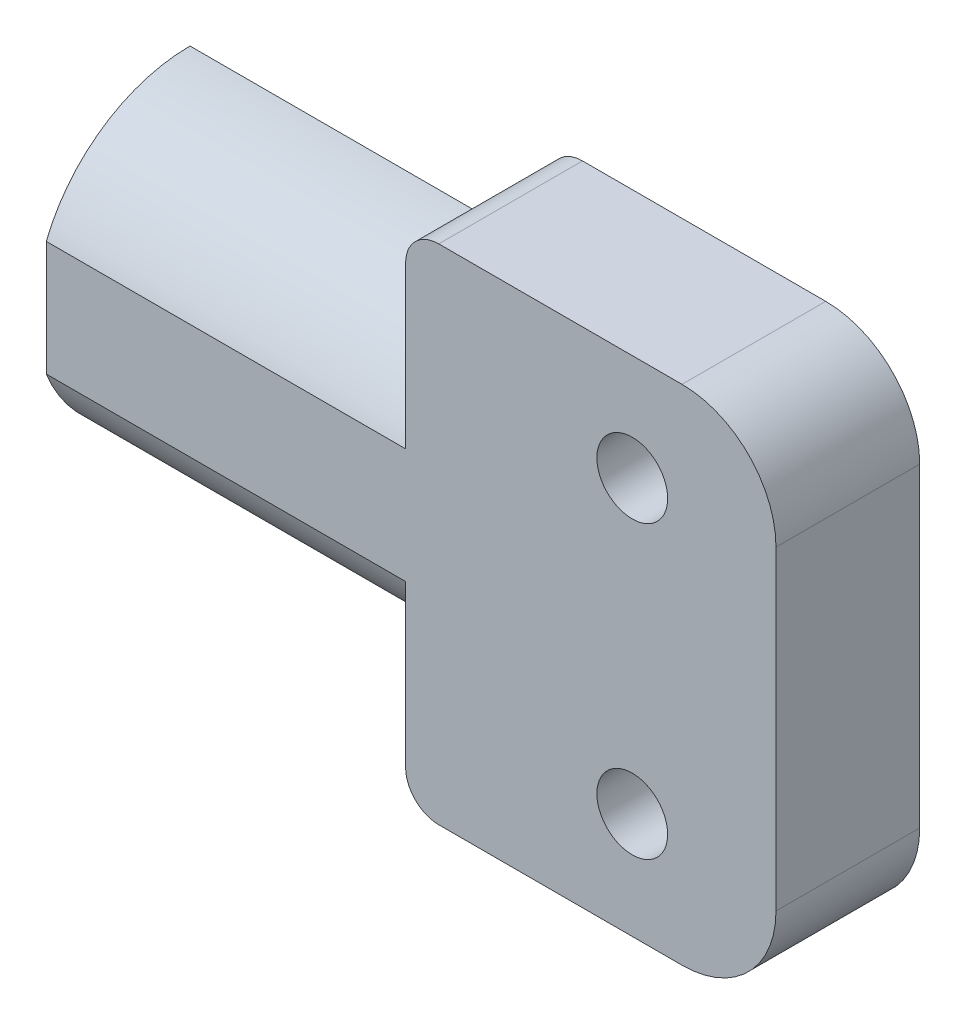
ISO-10303-21;
HEADER;
FILE_DESCRIPTION(('STEP AP214'),'2;1');
FILE_NAME('part.step','',(''),(''),'','','');
FILE_SCHEMA(('AUTOMOTIVE_DESIGN { 1 0 10303 214 1 1 1 1 }'));
ENDSEC;
DATA;
#1=APPLICATION_CONTEXT('core data for automotive mechanical design processes');
#2=APPLICATION_PROTOCOL_DEFINITION('international standard','automotive_design',2000,#1);
#3=PRODUCT_CONTEXT('',#1,'mechanical');
#4=PRODUCT('Part','Part','',(#3));
#5=PRODUCT_RELATED_PRODUCT_CATEGORY('part','',(#4));
#6=PRODUCT_DEFINITION_FORMATION('','',#4);
#7=PRODUCT_DEFINITION_CONTEXT('part definition',#1,'design');
#8=PRODUCT_DEFINITION('design','',#6,#7);
#9=PRODUCT_DEFINITION_SHAPE('','',#8);
#10=(LENGTH_UNIT() NAMED_UNIT(*) SI_UNIT(.MILLI.,.METRE.));
#11=(NAMED_UNIT(*) PLANE_ANGLE_UNIT() SI_UNIT($,.RADIAN.));
#12=(NAMED_UNIT(*) SI_UNIT($,.STERADIAN.) SOLID_ANGLE_UNIT());
#13=UNCERTAINTY_MEASURE_WITH_UNIT(LENGTH_MEASURE(1.E-05),#10,'distance_accuracy_value','');
#14=(GEOMETRIC_REPRESENTATION_CONTEXT(3) GLOBAL_UNCERTAINTY_ASSIGNED_CONTEXT((#13)) GLOBAL_UNIT_ASSIGNED_CONTEXT((#10,
#11,#12)) REPRESENTATION_CONTEXT('',''));
#15=CARTESIAN_POINT('',(0.,0.,0.));
#16=DIRECTION('',(0.,0.,1.));
#17=DIRECTION('',(1.,0.,0.));
#18=AXIS2_PLACEMENT_3D('',#15,#16,#17);
#19=CARTESIAN_POINT('',(157.,109.,110.1));
#20=DIRECTION('',(0.,0.,1.));
#21=DIRECTION('',(1.,0.,0.));
#22=AXIS2_PLACEMENT_3D('',#19,#20,#21);
#23=PLANE('',#22);
#24=CARTESIAN_POINT('',(177.,95.845,110.1));
#25=DIRECTION('',(0.,0.,-1.));
#26=DIRECTION('',(-1.,0.,0.));
#27=AXIS2_PLACEMENT_3D('',#24,#25,#26);
#28=CIRCLE('',#27,3.2);
#29=CARTESIAN_POINT('',(173.8,95.845,110.1));
#30=VERTEX_POINT('',#29);
#31=EDGE_CURVE('E160',#30,#30,#28,.T.);
#32=ORIENTED_EDGE('',*,*,#31,.T.);
#33=EDGE_LOOP('',(#32));
#34=FACE_BOUND('',#33,.T.);
#35=CARTESIAN_POINT('',(177.,122.155,110.1));
#36=DIRECTION('',(0.,0.,-1.));
#37=DIRECTION('',(-1.,0.,0.));
#38=AXIS2_PLACEMENT_3D('',#35,#36,#37);
#39=CIRCLE('',#38,3.2);
#40=CARTESIAN_POINT('',(173.8,122.155,110.1));
#41=VERTEX_POINT('',#40);
#42=EDGE_CURVE('E163',#41,#41,#39,.T.);
#43=ORIENTED_EDGE('',*,*,#42,.T.);
#44=EDGE_LOOP('',(#43));
#45=FACE_BOUND('',#44,.T.);
#46=CARTESIAN_POINT('',(159.5,89.25,110.1));
#47=DIRECTION('',(0.,0.,1.));
#48=DIRECTION('',(1.,0.,0.));
#49=AXIS2_PLACEMENT_3D('',#46,#47,#48);
#50=CIRCLE('',#49,3.);
#51=CARTESIAN_POINT('',(159.5,86.25,110.1));
#52=VERTEX_POINT('',#51);
#53=CARTESIAN_POINT('',(156.5,89.25,110.1));
#54=VERTEX_POINT('',#53);
#55=EDGE_CURVE('E168',#52,#54,#50,.F.);
#56=ORIENTED_EDGE('',*,*,#55,.F.);
#57=DIRECTION('',(1.,0.,0.));
#58=VECTOR('',#57,1.);
#59=CARTESIAN_POINT('',(156.5,86.25,110.1));
#60=LINE('',#59,#58);
#61=CARTESIAN_POINT('',(181.5,86.25,110.1));
#62=VERTEX_POINT('',#61);
#63=EDGE_CURVE('E129',#62,#52,#60,.F.);
#64=ORIENTED_EDGE('',*,*,#63,.F.);
#65=CARTESIAN_POINT('',(181.5,94.75,110.1));
#66=DIRECTION('',(0.,0.,1.));
#67=DIRECTION('',(1.,0.,0.));
#68=AXIS2_PLACEMENT_3D('',#65,#66,#67);
#69=CIRCLE('',#68,8.5);
#70=CARTESIAN_POINT('',(190.,94.75,110.1));
#71=VERTEX_POINT('',#70);
#72=EDGE_CURVE('E116',#71,#62,#69,.F.);
#73=ORIENTED_EDGE('',*,*,#72,.F.);
#74=DIRECTION('',(0.,1.,0.));
#75=VECTOR('',#74,1.);
#76=CARTESIAN_POINT('',(190.,86.25,110.1));
#77=LINE('',#76,#75);
#78=CARTESIAN_POINT('',(190.,123.25,110.1));
#79=VERTEX_POINT('',#78);
#80=EDGE_CURVE('E112',#79,#71,#77,.F.);
#81=ORIENTED_EDGE('',*,*,#80,.F.);
#82=CARTESIAN_POINT('',(181.5,123.25,110.1));
#83=DIRECTION('',(0.,0.,1.));
#84=DIRECTION('',(1.,0.,0.));
#85=AXIS2_PLACEMENT_3D('',#82,#83,#84);
#86=CIRCLE('',#85,8.5);
#87=CARTESIAN_POINT('',(181.5,131.75,110.1));
#88=VERTEX_POINT('',#87);
#89=EDGE_CURVE('E19',#88,#79,#86,.F.);
#90=ORIENTED_EDGE('',*,*,#89,.F.);
#91=DIRECTION('',(-1.,0.,0.));
#92=VECTOR('',#91,1.);
#93=CARTESIAN_POINT('',(190.,131.75,110.1));
#94=LINE('',#93,#92);
#95=CARTESIAN_POINT('',(159.5,131.75,110.1));
#96=VERTEX_POINT('',#95);
#97=EDGE_CURVE('E125',#96,#88,#94,.F.);
#98=ORIENTED_EDGE('',*,*,#97,.F.);
#99=CARTESIAN_POINT('',(159.5,128.75,110.1));
#100=DIRECTION('',(0.,0.,1.));
#101=DIRECTION('',(1.,0.,0.));
#102=AXIS2_PLACEMENT_3D('',#99,#100,#101);
#103=CIRCLE('',#102,3.);
#104=CARTESIAN_POINT('',(156.5,128.75,110.1));
#105=VERTEX_POINT('',#104);
#106=EDGE_CURVE('E142',#105,#96,#103,.F.);
#107=ORIENTED_EDGE('',*,*,#106,.F.);
#108=DIRECTION('',(0.,-1.,0.));
#109=VECTOR('',#108,1.);
#110=CARTESIAN_POINT('',(156.5,131.75,110.1));
#111=LINE('',#110,#109);
#112=CARTESIAN_POINT('',(156.5,114.196152422707,110.1));
#113=VERTEX_POINT('',#112);
#114=EDGE_CURVE('E175',#113,#105,#111,.F.);
#115=ORIENTED_EDGE('',*,*,#114,.F.);
#116=DIRECTION('',(1.,0.,0.));
#117=VECTOR('',#116,1.);
#118=CARTESIAN_POINT('',(124.,114.196152422707,110.1));
#119=LINE('',#118,#117);
#120=CARTESIAN_POINT('',(124.,114.196152422707,110.1));
#121=VERTEX_POINT('',#120);
#122=EDGE_CURVE('E137',#121,#113,#119,.T.);
#123=ORIENTED_EDGE('',*,*,#122,.F.);
#124=DIRECTION('',(0.,1.,0.));
#125=VECTOR('',#124,1.);
#126=CARTESIAN_POINT('',(124.,123.,110.1));
#127=LINE('',#126,#125);
#128=CARTESIAN_POINT('',(124.,103.803847577293,110.1));
#129=VERTEX_POINT('',#128);
#130=EDGE_CURVE('E136',#129,#121,#127,.T.);
#131=ORIENTED_EDGE('',*,*,#130,.F.);
#132=DIRECTION('',(1.,0.,0.));
#133=VECTOR('',#132,1.);
#134=CARTESIAN_POINT('',(124.,103.803847577293,110.1));
#135=LINE('',#134,#133);
#136=CARTESIAN_POINT('',(156.5,103.803847577293,110.1));
#137=VERTEX_POINT('',#136);
#138=EDGE_CURVE('E133',#137,#129,#135,.F.);
#139=ORIENTED_EDGE('',*,*,#138,.F.);
#140=DIRECTION('',(0.,1.,0.));
#141=VECTOR('',#140,1.);
#142=CARTESIAN_POINT('',(156.5,95.,110.1));
#143=LINE('',#142,#141);
#144=EDGE_CURVE('E172',#54,#137,#143,.T.);
#145=ORIENTED_EDGE('',*,*,#144,.F.);
#146=EDGE_LOOP('',(#56,#64,#73,#81,#90,#98,#107,#115,#123,#131,#139,#145));
#147=FACE_BOUND('',#146,.T.);
#148=ADVANCED_FACE('F16',(#34,#45,#147),#23,.T.);
#149=CARTESIAN_POINT('',(190.,86.25,97.1));
#150=DIRECTION('',(1.,0.,0.));
#151=DIRECTION('',(0.,1.,0.));
#152=AXIS2_PLACEMENT_3D('',#149,#150,#151);
#153=PLANE('',#152);
#154=DIRECTION('',(0.,0.,1.));
#155=VECTOR('',#154,1.);
#156=CARTESIAN_POINT('',(190.,123.25,97.1));
#157=LINE('',#156,#155);
#158=CARTESIAN_POINT('',(190.,123.25,97.1));
#159=VERTEX_POINT('',#158);
#160=EDGE_CURVE('E109',#79,#159,#157,.F.);
#161=ORIENTED_EDGE('',*,*,#160,.F.);
#162=ORIENTED_EDGE('',*,*,#80,.T.);
#163=DIRECTION('',(0.,0.,1.));
#164=VECTOR('',#163,1.);
#165=CARTESIAN_POINT('',(190.,94.75,97.1));
#166=LINE('',#165,#164);
#167=CARTESIAN_POINT('',(190.,94.75,97.1));
#168=VERTEX_POINT('',#167);
#169=EDGE_CURVE('E166',#168,#71,#166,.T.);
#170=ORIENTED_EDGE('',*,*,#169,.F.);
#171=DIRECTION('',(0.,1.,0.));
#172=VECTOR('',#171,1.);
#173=CARTESIAN_POINT('',(190.,109.,97.1));
#174=LINE('',#173,#172);
#175=EDGE_CURVE('E123',#168,#159,#174,.T.);
#176=ORIENTED_EDGE('',*,*,#175,.T.);
#177=EDGE_LOOP('',(#161,#162,#170,#176));
#178=FACE_BOUND('',#177,.T.);
#179=ADVANCED_FACE('F122',(#178),#153,.T.);
#180=CARTESIAN_POINT('',(181.5,123.25,97.1));
#181=DIRECTION('',(0.,0.,1.));
#182=DIRECTION('',(1.,0.,0.));
#183=AXIS2_PLACEMENT_3D('',#180,#181,#182);
#184=CYLINDRICAL_SURFACE('',#183,8.5);
#185=CARTESIAN_POINT('',(181.5,123.25,97.1));
#186=DIRECTION('',(0.,0.,1.));
#187=DIRECTION('',(1.,0.,0.));
#188=AXIS2_PLACEMENT_3D('',#185,#186,#187);
#189=CIRCLE('',#188,8.5);
#190=CARTESIAN_POINT('',(181.5,131.75,97.1));
#191=VERTEX_POINT('',#190);
#192=EDGE_CURVE('E158',#159,#191,#189,.T.);
#193=ORIENTED_EDGE('',*,*,#192,.T.);
#194=DIRECTION('',(0.,0.,1.));
#195=VECTOR('',#194,1.);
#196=CARTESIAN_POINT('',(181.5,131.75,97.1));
#197=LINE('',#196,#195);
#198=EDGE_CURVE('E111',#88,#191,#197,.F.);
#199=ORIENTED_EDGE('',*,*,#198,.F.);
#200=ORIENTED_EDGE('',*,*,#89,.T.);
#201=ORIENTED_EDGE('',*,*,#160,.T.);
#202=EDGE_LOOP('',(#193,#199,#200,#201));
#203=FACE_BOUND('',#202,.T.);
#204=ADVANCED_FACE('F107',(#203),#184,.T.);
#205=CARTESIAN_POINT('',(190.,131.75,97.1));
#206=DIRECTION('',(0.,1.,0.));
#207=DIRECTION('',(-1.,0.,0.));
#208=AXIS2_PLACEMENT_3D('',#205,#206,#207);
#209=PLANE('',#208);
#210=DIRECTION('',(0.,0.,1.));
#211=VECTOR('',#210,1.);
#212=CARTESIAN_POINT('',(159.5,131.75,97.1));
#213=LINE('',#212,#211);
#214=CARTESIAN_POINT('',(159.5,131.75,97.1));
#215=VERTEX_POINT('',#214);
#216=EDGE_CURVE('E176',#96,#215,#213,.F.);
#217=ORIENTED_EDGE('',*,*,#216,.F.);
#218=ORIENTED_EDGE('',*,*,#97,.T.);
#219=ORIENTED_EDGE('',*,*,#198,.T.);
#220=DIRECTION('',(1.,0.,0.));
#221=VECTOR('',#220,1.);
#222=CARTESIAN_POINT('',(157.,131.75,97.1));
#223=LINE('',#222,#221);
#224=EDGE_CURVE('E157',#191,#215,#223,.F.);
#225=ORIENTED_EDGE('',*,*,#224,.T.);
#226=EDGE_LOOP('',(#217,#218,#219,#225));
#227=FACE_BOUND('',#226,.T.);
#228=ADVANCED_FACE('F245',(#227),#209,.T.);
#229=CARTESIAN_POINT('',(159.5,128.75,97.1));
#230=DIRECTION('',(0.,0.,1.));
#231=DIRECTION('',(1.,0.,0.));
#232=AXIS2_PLACEMENT_3D('',#229,#230,#231);
#233=CYLINDRICAL_SURFACE('',#232,3.);
#234=CARTESIAN_POINT('',(159.5,128.75,97.1));
#235=DIRECTION('',(0.,0.,1.));
#236=DIRECTION('',(1.,0.,0.));
#237=AXIS2_PLACEMENT_3D('',#234,#235,#236);
#238=CIRCLE('',#237,3.);
#239=CARTESIAN_POINT('',(156.5,128.75,97.1));
#240=VERTEX_POINT('',#239);
#241=EDGE_CURVE('E153',#215,#240,#238,.T.);
#242=ORIENTED_EDGE('',*,*,#241,.T.);
#243=DIRECTION('',(0.,0.,1.));
#244=VECTOR('',#243,1.);
#245=CARTESIAN_POINT('',(156.5,128.75,97.1));
#246=LINE('',#245,#244);
#247=EDGE_CURVE('E179',#105,#240,#246,.F.);
#248=ORIENTED_EDGE('',*,*,#247,.F.);
#249=ORIENTED_EDGE('',*,*,#106,.T.);
#250=ORIENTED_EDGE('',*,*,#216,.T.);
#251=EDGE_LOOP('',(#242,#248,#249,#250));
#252=FACE_BOUND('',#251,.T.);
#253=ADVANCED_FACE('F243',(#252),#233,.T.);
#254=CARTESIAN_POINT('',(156.5,131.75,97.1));
#255=DIRECTION('',(-1.,0.,0.));
#256=DIRECTION('',(0.,-1.,0.));
#257=AXIS2_PLACEMENT_3D('',#254,#255,#256);
#258=PLANE('',#257);
#259=CARTESIAN_POINT('',(156.5,109.,97.1));
#260=DIRECTION('',(1.,0.,0.));
#261=DIRECTION('',(0.,0.,-1.));
#262=AXIS2_PLACEMENT_3D('',#259,#260,#261);
#263=CIRCLE('',#262,14.);
#264=CARTESIAN_POINT('',(156.5,123.,97.1));
#265=VERTEX_POINT('',#264);
#266=EDGE_CURVE('E141',#113,#265,#263,.F.);
#267=ORIENTED_EDGE('',*,*,#266,.F.);
#268=ORIENTED_EDGE('',*,*,#114,.T.);
#269=ORIENTED_EDGE('',*,*,#247,.T.);
#270=DIRECTION('',(0.,1.,0.));
#271=VECTOR('',#270,1.);
#272=CARTESIAN_POINT('',(156.5,109.,97.1));
#273=LINE('',#272,#271);
#274=EDGE_CURVE('E156',#240,#265,#273,.F.);
#275=ORIENTED_EDGE('',*,*,#274,.T.);
#276=EDGE_LOOP('',(#267,#268,#269,#275));
#277=FACE_BOUND('',#276,.T.);
#278=ADVANCED_FACE('F241',(#277),#258,.T.);
#279=CARTESIAN_POINT('',(124.,109.,97.1));
#280=DIRECTION('',(1.,0.,0.));
#281=DIRECTION('',(0.,0.,-1.));
#282=AXIS2_PLACEMENT_3D('',#279,#280,#281);
#283=CYLINDRICAL_SURFACE('',#282,14.);
#284=CARTESIAN_POINT('',(124.,109.,97.1));
#285=DIRECTION('',(1.,0.,0.));
#286=DIRECTION('',(0.,0.,-1.));
#287=AXIS2_PLACEMENT_3D('',#284,#285,#286);
#288=CIRCLE('',#287,14.);
#289=CARTESIAN_POINT('',(124.,123.,97.1));
#290=VERTEX_POINT('',#289);
#291=EDGE_CURVE('E140',#121,#290,#288,.F.);
#292=ORIENTED_EDGE('',*,*,#291,.F.);
#293=ORIENTED_EDGE('',*,*,#122,.T.);
#294=ORIENTED_EDGE('',*,*,#266,.T.);
#295=DIRECTION('',(1.,0.,0.));
#296=VECTOR('',#295,1.);
#297=CARTESIAN_POINT('',(157.,123.,97.1));
#298=LINE('',#297,#296);
#299=EDGE_CURVE('E186',#265,#290,#298,.F.);
#300=ORIENTED_EDGE('',*,*,#299,.T.);
#301=EDGE_LOOP('',(#292,#293,#294,#300));
#302=FACE_BOUND('',#301,.T.);
#303=ADVANCED_FACE('F238',(#302),#283,.T.);
#304=CARTESIAN_POINT('',(124.,123.,97.1));
#305=DIRECTION('',(-1.,0.,0.));
#306=DIRECTION('',(0.,0.,1.));
#307=AXIS2_PLACEMENT_3D('',#304,#305,#306);
#308=PLANE('',#307);
#309=CARTESIAN_POINT('',(124.,109.,97.1));
#310=DIRECTION('',(1.,0.,0.));
#311=DIRECTION('',(0.,0.,-1.));
#312=AXIS2_PLACEMENT_3D('',#309,#310,#311);
#313=CIRCLE('',#312,14.);
#314=CARTESIAN_POINT('',(124.,95.,97.1));
#315=VERTEX_POINT('',#314);
#316=EDGE_CURVE('E135',#129,#315,#313,.T.);
#317=ORIENTED_EDGE('',*,*,#316,.F.);
#318=ORIENTED_EDGE('',*,*,#130,.T.);
#319=ORIENTED_EDGE('',*,*,#291,.T.);
#320=DIRECTION('',(0.,1.,0.));
#321=VECTOR('',#320,1.);
#322=CARTESIAN_POINT('',(124.,109.,97.1));
#323=LINE('',#322,#321);
#324=EDGE_CURVE('E189',#290,#315,#323,.F.);
#325=ORIENTED_EDGE('',*,*,#324,.T.);
#326=EDGE_LOOP('',(#317,#318,#319,#325));
#327=FACE_BOUND('',#326,.T.);
#328=ADVANCED_FACE('F233',(#327),#308,.T.);
#329=CARTESIAN_POINT('',(124.,109.,97.1));
#330=DIRECTION('',(1.,0.,0.));
#331=DIRECTION('',(0.,0.,-1.));
#332=AXIS2_PLACEMENT_3D('',#329,#330,#331);
#333=CYLINDRICAL_SURFACE('',#332,14.);
#334=ORIENTED_EDGE('',*,*,#316,.T.);
#335=DIRECTION('',(1.,0.,0.));
#336=VECTOR('',#335,1.);
#337=CARTESIAN_POINT('',(157.,95.,97.1));
#338=LINE('',#337,#336);
#339=CARTESIAN_POINT('',(156.5,95.,97.1));
#340=VERTEX_POINT('',#339);
#341=EDGE_CURVE('E194',#315,#340,#338,.T.);
#342=ORIENTED_EDGE('',*,*,#341,.T.);
#343=CARTESIAN_POINT('',(156.5,109.,97.1));
#344=DIRECTION('',(1.,0.,0.));
#345=DIRECTION('',(0.,0.,-1.));
#346=AXIS2_PLACEMENT_3D('',#343,#344,#345);
#347=CIRCLE('',#346,14.);
#348=EDGE_CURVE('E170',#137,#340,#347,.T.);
#349=ORIENTED_EDGE('',*,*,#348,.F.);
#350=ORIENTED_EDGE('',*,*,#138,.T.);
#351=EDGE_LOOP('',(#334,#342,#349,#350));
#352=FACE_BOUND('',#351,.T.);
#353=ADVANCED_FACE('F229',(#352),#333,.T.);
#354=CARTESIAN_POINT('',(156.5,95.,97.1));
#355=DIRECTION('',(-1.,0.,0.));
#356=DIRECTION('',(0.,0.,1.));
#357=AXIS2_PLACEMENT_3D('',#354,#355,#356);
#358=PLANE('',#357);
#359=ORIENTED_EDGE('',*,*,#348,.T.);
#360=DIRECTION('',(0.,1.,0.));
#361=VECTOR('',#360,1.);
#362=CARTESIAN_POINT('',(156.5,109.,97.1));
#363=LINE('',#362,#361);
#364=CARTESIAN_POINT('',(156.5,89.25,97.1));
#365=VERTEX_POINT('',#364);
#366=EDGE_CURVE('E152',#340,#365,#363,.F.);
#367=ORIENTED_EDGE('',*,*,#366,.T.);
#368=DIRECTION('',(0.,0.,1.));
#369=VECTOR('',#368,1.);
#370=CARTESIAN_POINT('',(156.5,89.25,97.1));
#371=LINE('',#370,#369);
#372=EDGE_CURVE('E132',#54,#365,#371,.F.);
#373=ORIENTED_EDGE('',*,*,#372,.F.);
#374=ORIENTED_EDGE('',*,*,#144,.T.);
#375=EDGE_LOOP('',(#359,#367,#373,#374));
#376=FACE_BOUND('',#375,.T.);
#377=ADVANCED_FACE('F223',(#376),#358,.T.);
#378=CARTESIAN_POINT('',(159.5,89.25,97.1));
#379=DIRECTION('',(0.,0.,1.));
#380=DIRECTION('',(1.,0.,0.));
#381=AXIS2_PLACEMENT_3D('',#378,#379,#380);
#382=CYLINDRICAL_SURFACE('',#381,3.);
#383=CARTESIAN_POINT('',(159.5,89.25,97.1));
#384=DIRECTION('',(0.,0.,1.));
#385=DIRECTION('',(1.,0.,0.));
#386=AXIS2_PLACEMENT_3D('',#383,#384,#385);
#387=CIRCLE('',#386,3.);
#388=CARTESIAN_POINT('',(159.5,86.25,97.1));
#389=VERTEX_POINT('',#388);
#390=EDGE_CURVE('E149',#365,#389,#387,.T.);
#391=ORIENTED_EDGE('',*,*,#390,.T.);
#392=DIRECTION('',(0.,0.,1.));
#393=VECTOR('',#392,1.);
#394=CARTESIAN_POINT('',(159.5,86.25,97.1));
#395=LINE('',#394,#393);
#396=EDGE_CURVE('E131',#52,#389,#395,.F.);
#397=ORIENTED_EDGE('',*,*,#396,.F.);
#398=ORIENTED_EDGE('',*,*,#55,.T.);
#399=ORIENTED_EDGE('',*,*,#372,.T.);
#400=EDGE_LOOP('',(#391,#397,#398,#399));
#401=FACE_BOUND('',#400,.T.);
#402=ADVANCED_FACE('F219',(#401),#382,.T.);
#403=CARTESIAN_POINT('',(156.5,86.25,97.1));
#404=DIRECTION('',(0.,-1.,0.));
#405=DIRECTION('',(1.,0.,0.));
#406=AXIS2_PLACEMENT_3D('',#403,#404,#405);
#407=PLANE('',#406);
#408=ORIENTED_EDGE('',*,*,#396,.T.);
#409=DIRECTION('',(1.,0.,0.));
#410=VECTOR('',#409,1.);
#411=CARTESIAN_POINT('',(157.,86.25,97.1));
#412=LINE('',#411,#410);
#413=CARTESIAN_POINT('',(181.5,86.25,97.1));
#414=VERTEX_POINT('',#413);
#415=EDGE_CURVE('E148',#389,#414,#412,.T.);
#416=ORIENTED_EDGE('',*,*,#415,.T.);
#417=DIRECTION('',(0.,0.,1.));
#418=VECTOR('',#417,1.);
#419=CARTESIAN_POINT('',(181.5,86.25,97.1));
#420=LINE('',#419,#418);
#421=EDGE_CURVE('E34',#62,#414,#420,.F.);
#422=ORIENTED_EDGE('',*,*,#421,.F.);
#423=ORIENTED_EDGE('',*,*,#63,.T.);
#424=EDGE_LOOP('',(#408,#416,#422,#423));
#425=FACE_BOUND('',#424,.T.);
#426=ADVANCED_FACE('F212',(#425),#407,.T.);
#427=CARTESIAN_POINT('',(181.5,94.75,97.1));
#428=DIRECTION('',(0.,0.,1.));
#429=DIRECTION('',(1.,0.,0.));
#430=AXIS2_PLACEMENT_3D('',#427,#428,#429);
#431=CYLINDRICAL_SURFACE('',#430,8.5);
#432=CARTESIAN_POINT('',(181.5,94.75,97.1));
#433=DIRECTION('',(0.,0.,1.));
#434=DIRECTION('',(1.,0.,0.));
#435=AXIS2_PLACEMENT_3D('',#432,#433,#434);
#436=CIRCLE('',#435,8.5);
#437=EDGE_CURVE('E146',#414,#168,#436,.T.);
#438=ORIENTED_EDGE('',*,*,#437,.T.);
#439=ORIENTED_EDGE('',*,*,#169,.T.);
#440=ORIENTED_EDGE('',*,*,#72,.T.);
#441=ORIENTED_EDGE('',*,*,#421,.T.);
#442=EDGE_LOOP('',(#438,#439,#440,#441));
#443=FACE_BOUND('',#442,.T.);
#444=ADVANCED_FACE('F270',(#443),#431,.T.);
#445=CARTESIAN_POINT('',(177.,122.155,95.8));
#446=DIRECTION('',(0.,0.,-1.));
#447=DIRECTION('',(-1.,0.,0.));
#448=AXIS2_PLACEMENT_3D('',#445,#446,#447);
#449=CYLINDRICAL_SURFACE('',#448,3.2);
#450=CARTESIAN_POINT('',(177.,122.155,97.1));
#451=DIRECTION('',(0.,0.,-1.));
#452=DIRECTION('',(-1.,0.,0.));
#453=AXIS2_PLACEMENT_3D('',#450,#451,#452);
#454=CIRCLE('',#453,3.2);
#455=CARTESIAN_POINT('',(173.8,122.155,97.1));
#456=VERTEX_POINT('',#455);
#457=EDGE_CURVE('E25',#456,#456,#454,.T.);
#458=ORIENTED_EDGE('',*,*,#457,.T.);
#459=EDGE_LOOP('',(#458));
#460=FACE_BOUND('',#459,.T.);
#461=ORIENTED_EDGE('',*,*,#42,.F.);
#462=EDGE_LOOP('',(#461));
#463=FACE_BOUND('',#462,.T.);
#464=ADVANCED_FACE('F262',(#460,#463),#449,.F.);
#465=CARTESIAN_POINT('',(177.,95.845,95.8));
#466=DIRECTION('',(0.,0.,-1.));
#467=DIRECTION('',(-1.,0.,0.));
#468=AXIS2_PLACEMENT_3D('',#465,#466,#467);
#469=CYLINDRICAL_SURFACE('',#468,3.2);
#470=CARTESIAN_POINT('',(177.,95.845,97.1));
#471=DIRECTION('',(0.,0.,-1.));
#472=DIRECTION('',(-1.,0.,0.));
#473=AXIS2_PLACEMENT_3D('',#470,#471,#472);
#474=CIRCLE('',#473,3.2);
#475=CARTESIAN_POINT('',(173.8,95.845,97.1));
#476=VERTEX_POINT('',#475);
#477=EDGE_CURVE('E11',#476,#476,#474,.T.);
#478=ORIENTED_EDGE('',*,*,#477,.T.);
#479=EDGE_LOOP('',(#478));
#480=FACE_BOUND('',#479,.T.);
#481=ORIENTED_EDGE('',*,*,#31,.F.);
#482=EDGE_LOOP('',(#481));
#483=FACE_BOUND('',#482,.T.);
#484=ADVANCED_FACE('F256',(#480,#483),#469,.F.);
#485=CARTESIAN_POINT('',(157.,109.,97.1));
#486=DIRECTION('',(0.,0.,1.));
#487=DIRECTION('',(1.,0.,0.));
#488=AXIS2_PLACEMENT_3D('',#485,#486,#487);
#489=PLANE('',#488);
#490=ORIENTED_EDGE('',*,*,#477,.F.);
#491=EDGE_LOOP('',(#490));
#492=FACE_BOUND('',#491,.T.);
#493=ORIENTED_EDGE('',*,*,#457,.F.);
#494=EDGE_LOOP('',(#493));
#495=FACE_BOUND('',#494,.T.);
#496=ORIENTED_EDGE('',*,*,#415,.F.);
#497=ORIENTED_EDGE('',*,*,#390,.F.);
#498=ORIENTED_EDGE('',*,*,#366,.F.);
#499=ORIENTED_EDGE('',*,*,#341,.F.);
#500=ORIENTED_EDGE('',*,*,#324,.F.);
#501=ORIENTED_EDGE('',*,*,#299,.F.);
#502=ORIENTED_EDGE('',*,*,#274,.F.);
#503=ORIENTED_EDGE('',*,*,#241,.F.);
#504=ORIENTED_EDGE('',*,*,#224,.F.);
#505=ORIENTED_EDGE('',*,*,#192,.F.);
#506=ORIENTED_EDGE('',*,*,#175,.F.);
#507=ORIENTED_EDGE('',*,*,#437,.F.);
#508=EDGE_LOOP('',(#496,#497,#498,#499,#500,#501,#502,#503,#504,#505,#506,#507));
#509=FACE_BOUND('',#508,.T.);
#510=ADVANCED_FACE('F216',(#492,#495,#509),#489,.F.);
#511=CLOSED_SHELL('',(#148,#179,#204,#228,#253,#278,#303,#328,#353,#377,#402,#426,#444,#464,
#484,#510));
#512=MANIFOLD_SOLID_BREP('B1',#511);
#513=ADVANCED_BREP_SHAPE_REPRESENTATION('',(#18,#512),#14);
#514=SHAPE_DEFINITION_REPRESENTATION(#9,#513);
ENDSEC;
END-ISO-10303-21;
